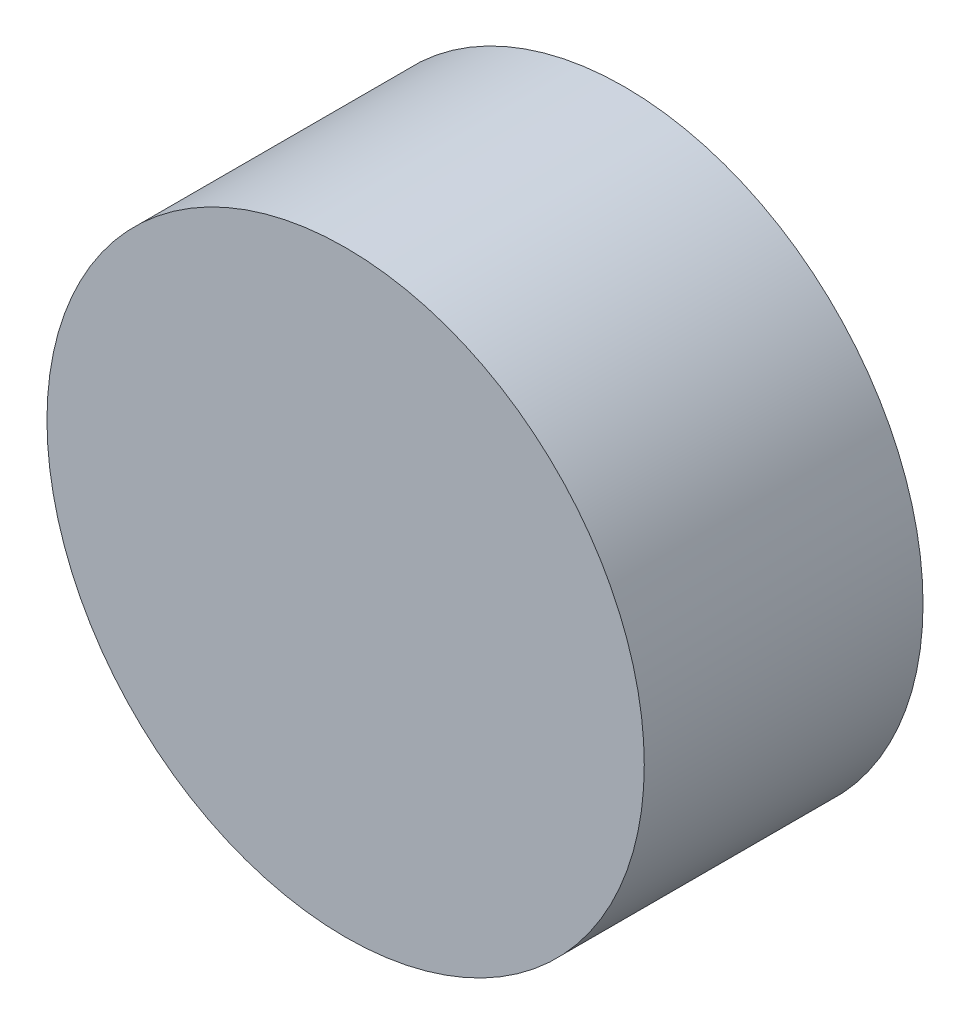
ISO-10303-21;
HEADER;
FILE_DESCRIPTION(('STEP AP214'),'2;1');
FILE_NAME('part.step','',(''),(''),'','','');
FILE_SCHEMA(('AUTOMOTIVE_DESIGN { 1 0 10303 214 1 1 1 1 }'));
ENDSEC;
DATA;
#1=APPLICATION_CONTEXT('core data for automotive mechanical design processes');
#2=APPLICATION_PROTOCOL_DEFINITION('international standard','automotive_design',2000,#1);
#3=PRODUCT_CONTEXT('',#1,'mechanical');
#4=PRODUCT('Part','Part','',(#3));
#5=PRODUCT_RELATED_PRODUCT_CATEGORY('part','',(#4));
#6=PRODUCT_DEFINITION_FORMATION('','',#4);
#7=PRODUCT_DEFINITION_CONTEXT('part definition',#1,'design');
#8=PRODUCT_DEFINITION('design','',#6,#7);
#9=PRODUCT_DEFINITION_SHAPE('','',#8);
#10=(LENGTH_UNIT() NAMED_UNIT(*) SI_UNIT(.MILLI.,.METRE.));
#11=(NAMED_UNIT(*) PLANE_ANGLE_UNIT() SI_UNIT($,.RADIAN.));
#12=(NAMED_UNIT(*) SI_UNIT($,.STERADIAN.) SOLID_ANGLE_UNIT());
#13=UNCERTAINTY_MEASURE_WITH_UNIT(LENGTH_MEASURE(1.E-05),#10,'distance_accuracy_value','');
#14=(GEOMETRIC_REPRESENTATION_CONTEXT(3) GLOBAL_UNCERTAINTY_ASSIGNED_CONTEXT((#13)) GLOBAL_UNIT_ASSIGNED_CONTEXT((#10,
#11,#12)) REPRESENTATION_CONTEXT('',''));
#15=CARTESIAN_POINT('',(0.,0.,0.));
#16=DIRECTION('',(0.,0.,1.));
#17=DIRECTION('',(1.,0.,0.));
#18=AXIS2_PLACEMENT_3D('',#15,#16,#17);
#19=CARTESIAN_POINT('',(0.,0.,8.89));
#20=DIRECTION('',(0.,0.,-1.));
#21=DIRECTION('',(-1.,0.,0.));
#22=AXIS2_PLACEMENT_3D('',#19,#20,#21);
#23=CYLINDRICAL_SURFACE('',#22,9.525);
#24=CARTESIAN_POINT('',(0.,0.,8.89));
#25=DIRECTION('',(0.,0.,1.));
#26=DIRECTION('',(1.,0.,0.));
#27=AXIS2_PLACEMENT_3D('',#24,#25,#26);
#28=CIRCLE('',#27,9.525);
#29=CARTESIAN_POINT('',(9.525,0.,8.89));
#30=VERTEX_POINT('',#29);
#31=EDGE_CURVE('E10',#30,#30,#28,.T.);
#32=ORIENTED_EDGE('',*,*,#31,.F.);
#33=EDGE_LOOP('',(#32));
#34=FACE_BOUND('',#33,.T.);
#35=CARTESIAN_POINT('',(0.,0.,0.));
#36=DIRECTION('',(0.,0.,1.));
#37=DIRECTION('',(1.,0.,0.));
#38=AXIS2_PLACEMENT_3D('',#35,#36,#37);
#39=CIRCLE('',#38,9.525);
#40=CARTESIAN_POINT('',(9.525,0.,0.));
#41=VERTEX_POINT('',#40);
#42=EDGE_CURVE('E34',#41,#41,#39,.T.);
#43=ORIENTED_EDGE('',*,*,#42,.T.);
#44=EDGE_LOOP('',(#43));
#45=FACE_BOUND('',#44,.T.);
#46=ADVANCED_FACE('F31',(#34,#45),#23,.T.);
#47=CARTESIAN_POINT('',(0.,0.,8.89));
#48=DIRECTION('',(0.,0.,1.));
#49=DIRECTION('',(1.,0.,0.));
#50=AXIS2_PLACEMENT_3D('',#47,#48,#49);
#51=PLANE('',#50);
#52=ORIENTED_EDGE('',*,*,#31,.T.);
#53=EDGE_LOOP('',(#52));
#54=FACE_BOUND('',#53,.T.);
#55=ADVANCED_FACE('F46',(#54),#51,.T.);
#56=CARTESIAN_POINT('',(0.,0.,0.));
#57=DIRECTION('',(0.,0.,1.));
#58=DIRECTION('',(1.,0.,0.));
#59=AXIS2_PLACEMENT_3D('',#56,#57,#58);
#60=PLANE('',#59);
#61=ORIENTED_EDGE('',*,*,#42,.F.);
#62=EDGE_LOOP('',(#61));
#63=FACE_BOUND('',#62,.T.);
#64=ADVANCED_FACE('F44',(#63),#60,.F.);
#65=CLOSED_SHELL('',(#46,#55,#64));
#66=MANIFOLD_SOLID_BREP('B2',#65);
#67=ADVANCED_BREP_SHAPE_REPRESENTATION('',(#18,#66),#14);
#68=SHAPE_DEFINITION_REPRESENTATION(#9,#67);
ENDSEC;
END-ISO-10303-21;
